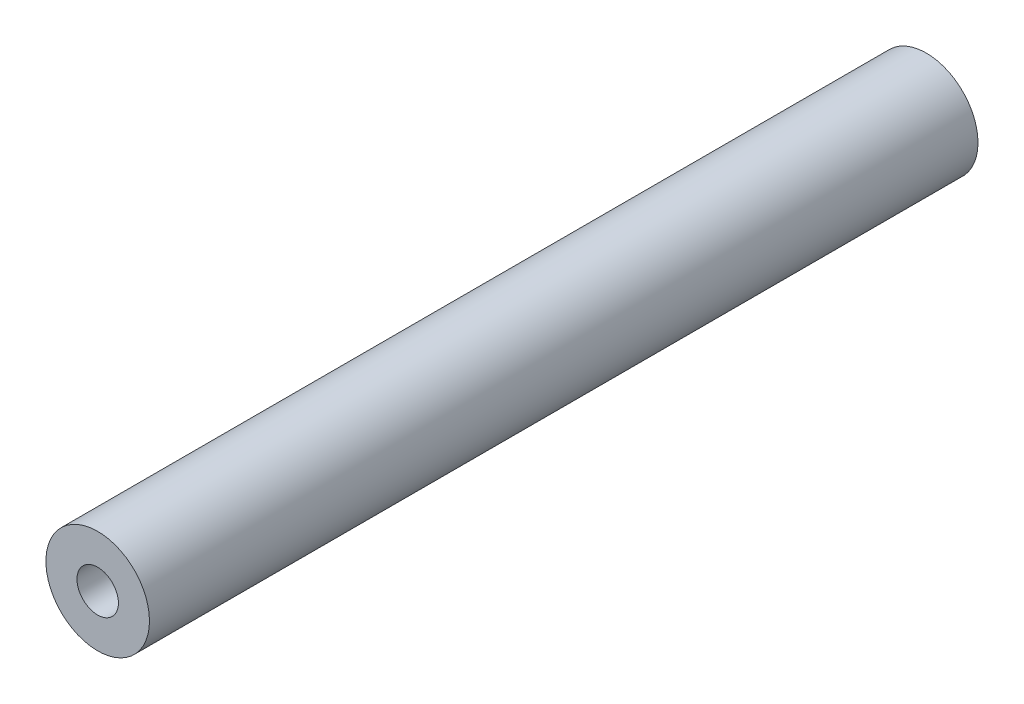
ISO-10303-21;
HEADER;
FILE_DESCRIPTION(('STEP AP214'),'2;1');
FILE_NAME('part.step','',(''),(''),'','','');
FILE_SCHEMA(('AUTOMOTIVE_DESIGN { 1 0 10303 214 1 1 1 1 }'));
ENDSEC;
DATA;
#1=APPLICATION_CONTEXT('core data for automotive mechanical design processes');
#2=APPLICATION_PROTOCOL_DEFINITION('international standard','automotive_design',2000,#1);
#3=PRODUCT_CONTEXT('',#1,'mechanical');
#4=PRODUCT('Part','Part','',(#3));
#5=PRODUCT_RELATED_PRODUCT_CATEGORY('part','',(#4));
#6=PRODUCT_DEFINITION_FORMATION('','',#4);
#7=PRODUCT_DEFINITION_CONTEXT('part definition',#1,'design');
#8=PRODUCT_DEFINITION('design','',#6,#7);
#9=PRODUCT_DEFINITION_SHAPE('','',#8);
#10=(LENGTH_UNIT() NAMED_UNIT(*) SI_UNIT(.MILLI.,.METRE.));
#11=(NAMED_UNIT(*) PLANE_ANGLE_UNIT() SI_UNIT($,.RADIAN.));
#12=(NAMED_UNIT(*) SI_UNIT($,.STERADIAN.) SOLID_ANGLE_UNIT());
#13=UNCERTAINTY_MEASURE_WITH_UNIT(LENGTH_MEASURE(1.E-05),#10,'distance_accuracy_value','');
#14=(GEOMETRIC_REPRESENTATION_CONTEXT(3) GLOBAL_UNCERTAINTY_ASSIGNED_CONTEXT((#13)) GLOBAL_UNIT_ASSIGNED_CONTEXT((#10,
#11,#12)) REPRESENTATION_CONTEXT('',''));
#15=CARTESIAN_POINT('',(0.,0.,0.));
#16=DIRECTION('',(0.,0.,1.));
#17=DIRECTION('',(1.,0.,0.));
#18=AXIS2_PLACEMENT_3D('',#15,#16,#17);
#19=CARTESIAN_POINT('',(0.,0.,400.));
#20=DIRECTION('',(0.,0.,1.));
#21=DIRECTION('',(1.,0.,0.));
#22=AXIS2_PLACEMENT_3D('',#19,#20,#21);
#23=PLANE('',#22);
#24=CARTESIAN_POINT('',(0.,0.,400.));
#25=DIRECTION('',(0.,0.,1.));
#26=DIRECTION('',(1.,0.,0.));
#27=AXIS2_PLACEMENT_3D('',#24,#25,#26);
#28=CIRCLE('',#27,25.);
#29=CARTESIAN_POINT('',(25.,0.,400.));
#30=VERTEX_POINT('',#29);
#31=EDGE_CURVE('E10',#30,#30,#28,.T.);
#32=ORIENTED_EDGE('',*,*,#31,.T.);
#33=EDGE_LOOP('',(#32));
#34=FACE_BOUND('',#33,.T.);
#35=CARTESIAN_POINT('',(0.,0.,400.));
#36=DIRECTION('',(0.,0.,1.));
#37=DIRECTION('',(1.,0.,0.));
#38=AXIS2_PLACEMENT_3D('',#35,#36,#37);
#39=CIRCLE('',#38,10.);
#40=CARTESIAN_POINT('',(10.,0.,400.));
#41=VERTEX_POINT('',#40);
#42=EDGE_CURVE('E42',#41,#41,#39,.T.);
#43=ORIENTED_EDGE('',*,*,#42,.F.);
#44=EDGE_LOOP('',(#43));
#45=FACE_BOUND('',#44,.T.);
#46=ADVANCED_FACE('F31',(#34,#45),#23,.T.);
#47=CARTESIAN_POINT('',(0.,0.,0.));
#48=DIRECTION('',(0.,0.,1.));
#49=DIRECTION('',(1.,0.,0.));
#50=AXIS2_PLACEMENT_3D('',#47,#48,#49);
#51=PLANE('',#50);
#52=CARTESIAN_POINT('',(0.,0.,0.));
#53=DIRECTION('',(0.,0.,1.));
#54=DIRECTION('',(1.,0.,0.));
#55=AXIS2_PLACEMENT_3D('',#52,#53,#54);
#56=CIRCLE('',#55,25.);
#57=CARTESIAN_POINT('',(25.,0.,0.));
#58=VERTEX_POINT('',#57);
#59=EDGE_CURVE('E35',#58,#58,#56,.T.);
#60=ORIENTED_EDGE('',*,*,#59,.F.);
#61=EDGE_LOOP('',(#60));
#62=FACE_BOUND('',#61,.T.);
#63=CARTESIAN_POINT('',(0.,0.,0.));
#64=DIRECTION('',(0.,0.,1.));
#65=DIRECTION('',(1.,0.,0.));
#66=AXIS2_PLACEMENT_3D('',#63,#64,#65);
#67=CIRCLE('',#66,10.);
#68=CARTESIAN_POINT('',(10.,0.,0.));
#69=VERTEX_POINT('',#68);
#70=EDGE_CURVE('E44',#69,#69,#67,.T.);
#71=ORIENTED_EDGE('',*,*,#70,.T.);
#72=EDGE_LOOP('',(#71));
#73=FACE_BOUND('',#72,.T.);
#74=ADVANCED_FACE('F54',(#62,#73),#51,.F.);
#75=CARTESIAN_POINT('',(0.,0.,400.));
#76=DIRECTION('',(0.,0.,-1.));
#77=DIRECTION('',(-1.,0.,0.));
#78=AXIS2_PLACEMENT_3D('',#75,#76,#77);
#79=CYLINDRICAL_SURFACE('',#78,25.);
#80=ORIENTED_EDGE('',*,*,#31,.F.);
#81=EDGE_LOOP('',(#80));
#82=FACE_BOUND('',#81,.T.);
#83=ORIENTED_EDGE('',*,*,#59,.T.);
#84=EDGE_LOOP('',(#83));
#85=FACE_BOUND('',#84,.T.);
#86=ADVANCED_FACE('F33',(#82,#85),#79,.T.);
#87=CARTESIAN_POINT('',(0.,0.,400.));
#88=DIRECTION('',(0.,0.,-1.));
#89=DIRECTION('',(-1.,0.,0.));
#90=AXIS2_PLACEMENT_3D('',#87,#88,#89);
#91=CYLINDRICAL_SURFACE('',#90,10.);
#92=ORIENTED_EDGE('',*,*,#42,.T.);
#93=EDGE_LOOP('',(#92));
#94=FACE_BOUND('',#93,.T.);
#95=ORIENTED_EDGE('',*,*,#70,.F.);
#96=EDGE_LOOP('',(#95));
#97=FACE_BOUND('',#96,.T.);
#98=ADVANCED_FACE('F50',(#94,#97),#91,.F.);
#99=CLOSED_SHELL('',(#46,#74,#86,#98));
#100=MANIFOLD_SOLID_BREP('B2',#99);
#101=ADVANCED_BREP_SHAPE_REPRESENTATION('',(#18,#100),#14);
#102=SHAPE_DEFINITION_REPRESENTATION(#9,#101);
ENDSEC;
END-ISO-10303-21;
